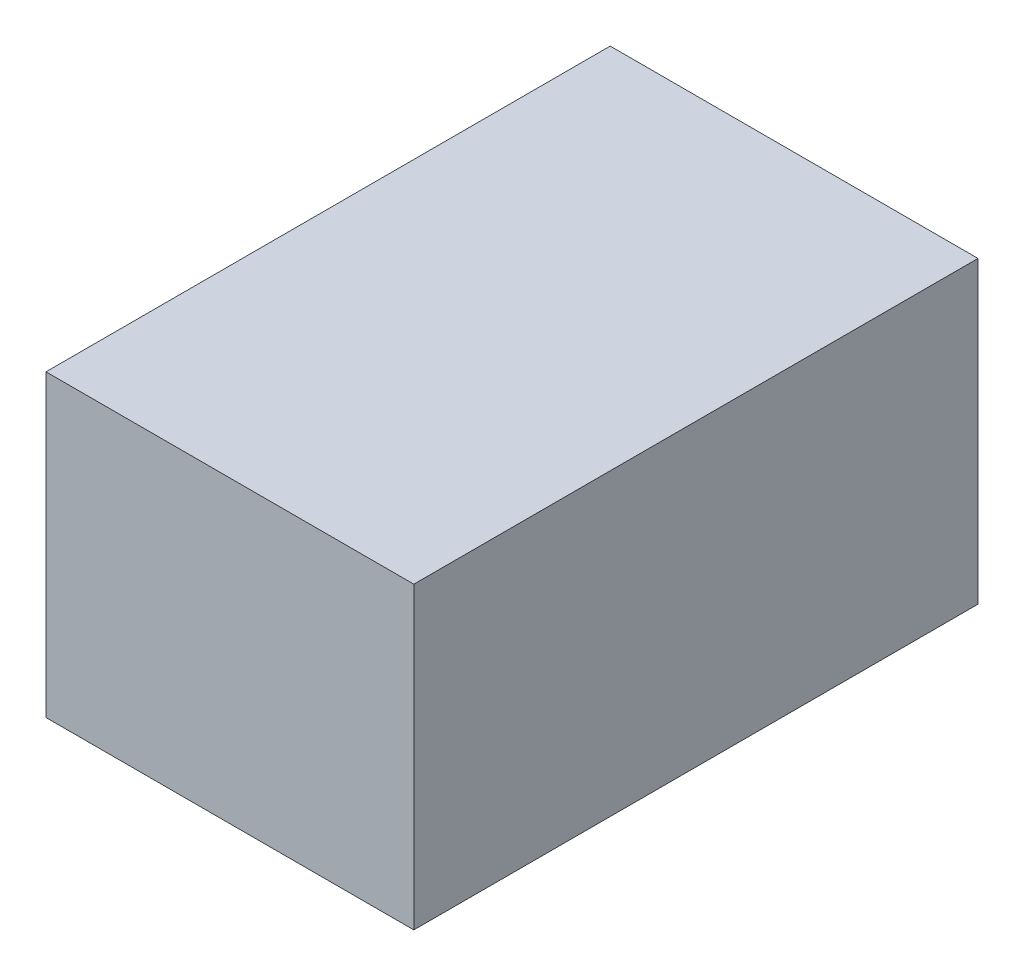
ISO-10303-21;
HEADER;
FILE_DESCRIPTION(('STEP AP214'),'2;1');
FILE_NAME('part.step','',(''),(''),'','','');
FILE_SCHEMA(('AUTOMOTIVE_DESIGN { 1 0 10303 214 1 1 1 1 }'));
ENDSEC;
DATA;
#1=APPLICATION_CONTEXT('core data for automotive mechanical design processes');
#2=APPLICATION_PROTOCOL_DEFINITION('international standard','automotive_design',2000,#1);
#3=PRODUCT_CONTEXT('',#1,'mechanical');
#4=PRODUCT('Part','Part','',(#3));
#5=PRODUCT_RELATED_PRODUCT_CATEGORY('part','',(#4));
#6=PRODUCT_DEFINITION_FORMATION('','',#4);
#7=PRODUCT_DEFINITION_CONTEXT('part definition',#1,'design');
#8=PRODUCT_DEFINITION('design','',#6,#7);
#9=PRODUCT_DEFINITION_SHAPE('','',#8);
#10=(LENGTH_UNIT() NAMED_UNIT(*) SI_UNIT(.MILLI.,.METRE.));
#11=(NAMED_UNIT(*) PLANE_ANGLE_UNIT() SI_UNIT($,.RADIAN.));
#12=(NAMED_UNIT(*) SI_UNIT($,.STERADIAN.) SOLID_ANGLE_UNIT());
#13=UNCERTAINTY_MEASURE_WITH_UNIT(LENGTH_MEASURE(1.E-05),#10,'distance_accuracy_value','');
#14=(GEOMETRIC_REPRESENTATION_CONTEXT(3) GLOBAL_UNCERTAINTY_ASSIGNED_CONTEXT((#13)) GLOBAL_UNIT_ASSIGNED_CONTEXT((#10,
#11,#12)) REPRESENTATION_CONTEXT('',''));
#15=CARTESIAN_POINT('',(0.,0.,0.));
#16=DIRECTION('',(0.,0.,1.));
#17=DIRECTION('',(1.,0.,0.));
#18=AXIS2_PLACEMENT_3D('',#15,#16,#17);
#19=CARTESIAN_POINT('',(109.2,88.9,335.));
#20=DIRECTION('',(-1.,0.,0.));
#21=DIRECTION('',(0.,-1.,0.));
#22=AXIS2_PLACEMENT_3D('',#19,#20,#21);
#23=PLANE('',#22);
#24=DIRECTION('',(0.,1.,0.));
#25=VECTOR('',#24,1.);
#26=CARTESIAN_POINT('',(109.2,88.9,0.));
#27=LINE('',#26,#25);
#28=CARTESIAN_POINT('',(109.199999999998,-88.9000000000006,0.));
#29=VERTEX_POINT('',#28);
#30=CARTESIAN_POINT('',(109.2,88.9,0.));
#31=VERTEX_POINT('',#30);
#32=EDGE_CURVE('E107',#29,#31,#27,.T.);
#33=ORIENTED_EDGE('',*,*,#32,.T.);
#34=DIRECTION('',(0.,0.,-1.));
#35=VECTOR('',#34,1.);
#36=CARTESIAN_POINT('',(109.2,88.9,335.));
#37=LINE('',#36,#35);
#38=CARTESIAN_POINT('',(109.2,88.9,335.));
#39=VERTEX_POINT('',#38);
#40=EDGE_CURVE('E11',#39,#31,#37,.T.);
#41=ORIENTED_EDGE('',*,*,#40,.F.);
#42=DIRECTION('',(0.,1.,0.));
#43=VECTOR('',#42,1.);
#44=CARTESIAN_POINT('',(109.2,88.9,335.));
#45=LINE('',#44,#43);
#46=CARTESIAN_POINT('',(109.199999999998,-88.9000000000006,335.));
#47=VERTEX_POINT('',#46);
#48=EDGE_CURVE('E91',#47,#39,#45,.T.);
#49=ORIENTED_EDGE('',*,*,#48,.F.);
#50=DIRECTION('',(0.,0.,-1.));
#51=VECTOR('',#50,1.);
#52=CARTESIAN_POINT('',(109.199999999998,-88.9000000000006,335.));
#53=LINE('',#52,#51);
#54=EDGE_CURVE('E103',#47,#29,#53,.T.);
#55=ORIENTED_EDGE('',*,*,#54,.T.);
#56=EDGE_LOOP('',(#33,#41,#49,#55));
#57=FACE_BOUND('',#56,.T.);
#58=ADVANCED_FACE('F39',(#57),#23,.F.);
#59=CARTESIAN_POINT('',(-109.2,88.9,335.));
#60=DIRECTION('',(0.,-1.,0.));
#61=DIRECTION('',(0.,0.,-1.));
#62=AXIS2_PLACEMENT_3D('',#59,#60,#61);
#63=PLANE('',#62);
#64=DIRECTION('',(-1.,0.,0.));
#65=VECTOR('',#64,1.);
#66=CARTESIAN_POINT('',(-109.2,88.9,0.));
#67=LINE('',#66,#65);
#68=CARTESIAN_POINT('',(-109.2,88.9,0.));
#69=VERTEX_POINT('',#68);
#70=EDGE_CURVE('E96',#31,#69,#67,.T.);
#71=ORIENTED_EDGE('',*,*,#70,.T.);
#72=DIRECTION('',(0.,0.,-1.));
#73=VECTOR('',#72,1.);
#74=CARTESIAN_POINT('',(-109.2,88.9,335.));
#75=LINE('',#74,#73);
#76=CARTESIAN_POINT('',(-109.2,88.9,335.));
#77=VERTEX_POINT('',#76);
#78=EDGE_CURVE('E48',#77,#69,#75,.T.);
#79=ORIENTED_EDGE('',*,*,#78,.F.);
#80=DIRECTION('',(-1.,0.,0.));
#81=VECTOR('',#80,1.);
#82=CARTESIAN_POINT('',(-109.2,88.9,335.));
#83=LINE('',#82,#81);
#84=EDGE_CURVE('E86',#39,#77,#83,.T.);
#85=ORIENTED_EDGE('',*,*,#84,.F.);
#86=ORIENTED_EDGE('',*,*,#40,.T.);
#87=EDGE_LOOP('',(#71,#79,#85,#86));
#88=FACE_BOUND('',#87,.T.);
#89=ADVANCED_FACE('F95',(#88),#63,.F.);
#90=CARTESIAN_POINT('',(-109.2,88.9,335.));
#91=DIRECTION('',(1.,0.,0.));
#92=DIRECTION('',(0.,1.,0.));
#93=AXIS2_PLACEMENT_3D('',#90,#91,#92);
#94=PLANE('',#93);
#95=DIRECTION('',(0.,-1.,0.));
#96=VECTOR('',#95,1.);
#97=CARTESIAN_POINT('',(-109.2,88.9,0.));
#98=LINE('',#97,#96);
#99=CARTESIAN_POINT('',(-109.200000000002,-88.9000000000006,0.));
#100=VERTEX_POINT('',#99);
#101=EDGE_CURVE('E73',#69,#100,#98,.T.);
#102=ORIENTED_EDGE('',*,*,#101,.T.);
#103=DIRECTION('',(0.,0.,-1.));
#104=VECTOR('',#103,1.);
#105=CARTESIAN_POINT('',(-109.200000000002,-88.9000000000006,335.));
#106=LINE('',#105,#104);
#107=CARTESIAN_POINT('',(-109.200000000002,-88.9000000000006,335.));
#108=VERTEX_POINT('',#107);
#109=EDGE_CURVE('E98',#108,#100,#106,.T.);
#110=ORIENTED_EDGE('',*,*,#109,.F.);
#111=DIRECTION('',(0.,-1.,0.));
#112=VECTOR('',#111,1.);
#113=CARTESIAN_POINT('',(-109.2,88.9,335.));
#114=LINE('',#113,#112);
#115=EDGE_CURVE('E89',#77,#108,#114,.T.);
#116=ORIENTED_EDGE('',*,*,#115,.F.);
#117=ORIENTED_EDGE('',*,*,#78,.T.);
#118=EDGE_LOOP('',(#102,#110,#116,#117));
#119=FACE_BOUND('',#118,.T.);
#120=ADVANCED_FACE('F99',(#119),#94,.F.);
#121=CARTESIAN_POINT('',(-109.200000000002,-88.9000000000006,335.));
#122=DIRECTION('',(0.,1.,0.));
#123=DIRECTION('',(0.,0.,1.));
#124=AXIS2_PLACEMENT_3D('',#121,#122,#123);
#125=PLANE('',#124);
#126=DIRECTION('',(1.,0.,0.));
#127=VECTOR('',#126,1.);
#128=CARTESIAN_POINT('',(-109.200000000002,-88.9000000000006,0.));
#129=LINE('',#128,#127);
#130=EDGE_CURVE('E79',#100,#29,#129,.T.);
#131=ORIENTED_EDGE('',*,*,#130,.T.);
#132=ORIENTED_EDGE('',*,*,#54,.F.);
#133=DIRECTION('',(1.,0.,0.));
#134=VECTOR('',#133,1.);
#135=CARTESIAN_POINT('',(-109.200000000002,-88.9000000000006,335.));
#136=LINE('',#135,#134);
#137=EDGE_CURVE('E56',#108,#47,#136,.T.);
#138=ORIENTED_EDGE('',*,*,#137,.F.);
#139=ORIENTED_EDGE('',*,*,#109,.T.);
#140=EDGE_LOOP('',(#131,#132,#138,#139));
#141=FACE_BOUND('',#140,.T.);
#142=ADVANCED_FACE('F120',(#141),#125,.F.);
#143=CARTESIAN_POINT('',(0.,0.,335.));
#144=DIRECTION('',(0.,0.,1.));
#145=DIRECTION('',(1.,0.,0.));
#146=AXIS2_PLACEMENT_3D('',#143,#144,#145);
#147=PLANE('',#146);
#148=ORIENTED_EDGE('',*,*,#48,.T.);
#149=ORIENTED_EDGE('',*,*,#84,.T.);
#150=ORIENTED_EDGE('',*,*,#115,.T.);
#151=ORIENTED_EDGE('',*,*,#137,.T.);
#152=EDGE_LOOP('',(#148,#149,#150,#151));
#153=FACE_BOUND('',#152,.T.);
#154=ADVANCED_FACE('F87',(#153),#147,.T.);
#155=CARTESIAN_POINT('',(0.,0.,0.));
#156=DIRECTION('',(0.,0.,1.));
#157=DIRECTION('',(1.,0.,0.));
#158=AXIS2_PLACEMENT_3D('',#155,#156,#157);
#159=PLANE('',#158);
#160=ORIENTED_EDGE('',*,*,#32,.F.);
#161=ORIENTED_EDGE('',*,*,#130,.F.);
#162=ORIENTED_EDGE('',*,*,#101,.F.);
#163=ORIENTED_EDGE('',*,*,#70,.F.);
#164=EDGE_LOOP('',(#160,#161,#162,#163));
#165=FACE_BOUND('',#164,.T.);
#166=ADVANCED_FACE('F123',(#165),#159,.F.);
#167=CLOSED_SHELL('',(#58,#89,#120,#142,#154,#166));
#168=MANIFOLD_SOLID_BREP('B2',#167);
#169=ADVANCED_BREP_SHAPE_REPRESENTATION('',(#18,#168),#14);
#170=SHAPE_DEFINITION_REPRESENTATION(#9,#169);
ENDSEC;
END-ISO-10303-21;
